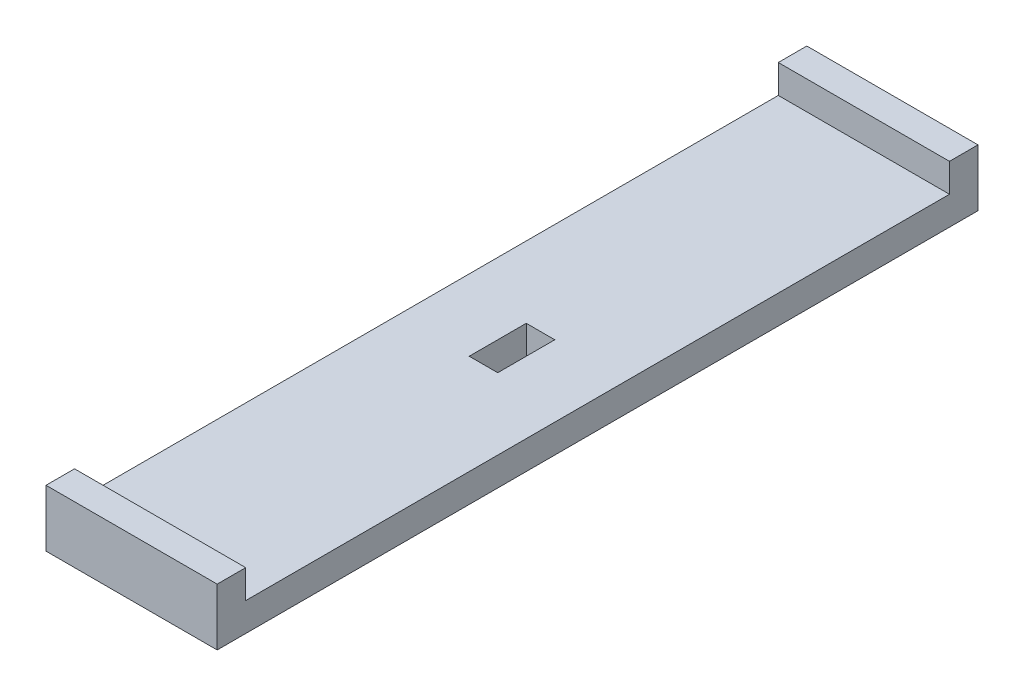
ISO-10303-21;
HEADER;
FILE_DESCRIPTION(('STEP AP214'),'2;1');
FILE_NAME('part.step','',(''),(''),'','','');
FILE_SCHEMA(('AUTOMOTIVE_DESIGN { 1 0 10303 214 1 1 1 1 }'));
ENDSEC;
DATA;
#1=APPLICATION_CONTEXT('core data for automotive mechanical design processes');
#2=APPLICATION_PROTOCOL_DEFINITION('international standard','automotive_design',2000,#1);
#3=PRODUCT_CONTEXT('',#1,'mechanical');
#4=PRODUCT('Part','Part','',(#3));
#5=PRODUCT_RELATED_PRODUCT_CATEGORY('part','',(#4));
#6=PRODUCT_DEFINITION_FORMATION('','',#4);
#7=PRODUCT_DEFINITION_CONTEXT('part definition',#1,'design');
#8=PRODUCT_DEFINITION('design','',#6,#7);
#9=PRODUCT_DEFINITION_SHAPE('','',#8);
#10=(LENGTH_UNIT() NAMED_UNIT(*) SI_UNIT(.MILLI.,.METRE.));
#11=(NAMED_UNIT(*) PLANE_ANGLE_UNIT() SI_UNIT($,.RADIAN.));
#12=(NAMED_UNIT(*) SI_UNIT($,.STERADIAN.) SOLID_ANGLE_UNIT());
#13=UNCERTAINTY_MEASURE_WITH_UNIT(LENGTH_MEASURE(1.E-05),#10,'distance_accuracy_value','');
#14=(GEOMETRIC_REPRESENTATION_CONTEXT(3) GLOBAL_UNCERTAINTY_ASSIGNED_CONTEXT((#13)) GLOBAL_UNIT_ASSIGNED_CONTEXT((#10,
#11,#12)) REPRESENTATION_CONTEXT('',''));
#15=CARTESIAN_POINT('',(0.,0.,0.));
#16=DIRECTION('',(0.,0.,1.));
#17=DIRECTION('',(1.,0.,0.));
#18=AXIS2_PLACEMENT_3D('',#15,#16,#17);
#19=CARTESIAN_POINT('',(0.,3.,0.));
#20=DIRECTION('',(0.,-1.,0.));
#21=DIRECTION('',(0.,0.,-1.));
#22=AXIS2_PLACEMENT_3D('',#19,#20,#21);
#23=PLANE('',#22);
#24=DIRECTION('',(0.,0.,-1.));
#25=VECTOR('',#24,1.);
#26=CARTESIAN_POINT('',(1.5,3.,3.));
#27=LINE('',#26,#25);
#28=CARTESIAN_POINT('',(1.5,3.,3.));
#29=VERTEX_POINT('',#28);
#30=CARTESIAN_POINT('',(1.5,3.,-3.));
#31=VERTEX_POINT('',#30);
#32=EDGE_CURVE('E167',#29,#31,#27,.T.);
#33=ORIENTED_EDGE('',*,*,#32,.F.);
#34=DIRECTION('',(1.,0.,0.));
#35=VECTOR('',#34,1.);
#36=CARTESIAN_POINT('',(-1.5,3.,3.));
#37=LINE('',#36,#35);
#38=CARTESIAN_POINT('',(-1.5,3.,3.));
#39=VERTEX_POINT('',#38);
#40=EDGE_CURVE('E175',#39,#29,#37,.T.);
#41=ORIENTED_EDGE('',*,*,#40,.F.);
#42=DIRECTION('',(0.,0.,1.));
#43=VECTOR('',#42,1.);
#44=CARTESIAN_POINT('',(-1.5,3.,3.));
#45=LINE('',#44,#43);
#46=CARTESIAN_POINT('',(-1.5,3.,-3.));
#47=VERTEX_POINT('',#46);
#48=EDGE_CURVE('E172',#47,#39,#45,.T.);
#49=ORIENTED_EDGE('',*,*,#48,.F.);
#50=DIRECTION('',(-1.,0.,0.));
#51=VECTOR('',#50,1.);
#52=CARTESIAN_POINT('',(-1.5,3.,-3.));
#53=LINE('',#52,#51);
#54=EDGE_CURVE('E169',#31,#47,#53,.T.);
#55=ORIENTED_EDGE('',*,*,#54,.F.);
#56=EDGE_LOOP('',(#33,#41,#49,#55));
#57=FACE_BOUND('',#56,.T.);
#58=DIRECTION('',(1.,0.,0.));
#59=VECTOR('',#58,1.);
#60=CARTESIAN_POINT('',(-9.00000000000001,3.,-37.));
#61=LINE('',#60,#59);
#62=CARTESIAN_POINT('',(-9.00000000000001,3.,-37.));
#63=VERTEX_POINT('',#62);
#64=CARTESIAN_POINT('',(9.,3.,-37.));
#65=VERTEX_POINT('',#64);
#66=EDGE_CURVE('E140',#63,#65,#61,.T.);
#67=ORIENTED_EDGE('',*,*,#66,.F.);
#68=DIRECTION('',(0.,0.,1.));
#69=VECTOR('',#68,1.);
#70=CARTESIAN_POINT('',(-9.,3.,40.));
#71=LINE('',#70,#69);
#72=CARTESIAN_POINT('',(-9.,3.,37.));
#73=VERTEX_POINT('',#72);
#74=EDGE_CURVE('E144',#63,#73,#71,.T.);
#75=ORIENTED_EDGE('',*,*,#74,.T.);
#76=DIRECTION('',(-1.,0.,0.));
#77=VECTOR('',#76,1.);
#78=CARTESIAN_POINT('',(8.99999999999999,3.,37.));
#79=LINE('',#78,#77);
#80=CARTESIAN_POINT('',(9.,3.,37.));
#81=VERTEX_POINT('',#80);
#82=EDGE_CURVE('E52',#81,#73,#79,.T.);
#83=ORIENTED_EDGE('',*,*,#82,.F.);
#84=DIRECTION('',(0.,0.,-1.));
#85=VECTOR('',#84,1.);
#86=CARTESIAN_POINT('',(9.,3.,40.));
#87=LINE('',#86,#85);
#88=EDGE_CURVE('E47',#81,#65,#87,.T.);
#89=ORIENTED_EDGE('',*,*,#88,.T.);
#90=EDGE_LOOP('',(#67,#75,#83,#89));
#91=FACE_BOUND('',#90,.T.);
#92=ADVANCED_FACE('F32',(#57,#91),#23,.F.);
#93=CARTESIAN_POINT('',(0.,0.,0.));
#94=DIRECTION('',(0.,-1.,0.));
#95=DIRECTION('',(0.,0.,-1.));
#96=AXIS2_PLACEMENT_3D('',#93,#94,#95);
#97=PLANE('',#96);
#98=DIRECTION('',(0.,0.,-1.));
#99=VECTOR('',#98,1.);
#100=CARTESIAN_POINT('',(9.,0.,40.));
#101=LINE('',#100,#99);
#102=CARTESIAN_POINT('',(9.,0.,40.));
#103=VERTEX_POINT('',#102);
#104=CARTESIAN_POINT('',(9.,0.,-40.));
#105=VERTEX_POINT('',#104);
#106=EDGE_CURVE('E197',#103,#105,#101,.T.);
#107=ORIENTED_EDGE('',*,*,#106,.F.);
#108=DIRECTION('',(1.,0.,0.));
#109=VECTOR('',#108,1.);
#110=CARTESIAN_POINT('',(-9.,0.,40.));
#111=LINE('',#110,#109);
#112=CARTESIAN_POINT('',(-9.,0.,40.));
#113=VERTEX_POINT('',#112);
#114=EDGE_CURVE('E199',#113,#103,#111,.T.);
#115=ORIENTED_EDGE('',*,*,#114,.F.);
#116=DIRECTION('',(0.,0.,1.));
#117=VECTOR('',#116,1.);
#118=CARTESIAN_POINT('',(-9.,0.,40.));
#119=LINE('',#118,#117);
#120=CARTESIAN_POINT('',(-9.,0.,-40.));
#121=VERTEX_POINT('',#120);
#122=EDGE_CURVE('E206',#121,#113,#119,.T.);
#123=ORIENTED_EDGE('',*,*,#122,.F.);
#124=DIRECTION('',(-1.,0.,0.));
#125=VECTOR('',#124,1.);
#126=CARTESIAN_POINT('',(-9.,0.,-40.));
#127=LINE('',#126,#125);
#128=EDGE_CURVE('E204',#105,#121,#127,.T.);
#129=ORIENTED_EDGE('',*,*,#128,.F.);
#130=EDGE_LOOP('',(#107,#115,#123,#129));
#131=FACE_BOUND('',#130,.T.);
#132=DIRECTION('',(1.,0.,0.));
#133=VECTOR('',#132,1.);
#134=CARTESIAN_POINT('',(-1.5,0.,3.));
#135=LINE('',#134,#133);
#136=CARTESIAN_POINT('',(-1.5,0.,3.));
#137=VERTEX_POINT('',#136);
#138=CARTESIAN_POINT('',(1.5,0.,3.));
#139=VERTEX_POINT('',#138);
#140=EDGE_CURVE('E170',#137,#139,#135,.T.);
#141=ORIENTED_EDGE('',*,*,#140,.T.);
#142=DIRECTION('',(0.,0.,-1.));
#143=VECTOR('',#142,1.);
#144=CARTESIAN_POINT('',(1.5,0.,3.));
#145=LINE('',#144,#143);
#146=CARTESIAN_POINT('',(1.5,0.,-3.));
#147=VERTEX_POINT('',#146);
#148=EDGE_CURVE('E166',#139,#147,#145,.T.);
#149=ORIENTED_EDGE('',*,*,#148,.T.);
#150=DIRECTION('',(-1.,0.,0.));
#151=VECTOR('',#150,1.);
#152=CARTESIAN_POINT('',(-1.5,0.,-3.));
#153=LINE('',#152,#151);
#154=CARTESIAN_POINT('',(-1.5,0.,-3.));
#155=VERTEX_POINT('',#154);
#156=EDGE_CURVE('E180',#147,#155,#153,.T.);
#157=ORIENTED_EDGE('',*,*,#156,.T.);
#158=DIRECTION('',(0.,0.,1.));
#159=VECTOR('',#158,1.);
#160=CARTESIAN_POINT('',(-1.5,0.,3.));
#161=LINE('',#160,#159);
#162=EDGE_CURVE('E183',#155,#137,#161,.T.);
#163=ORIENTED_EDGE('',*,*,#162,.T.);
#164=EDGE_LOOP('',(#141,#149,#157,#163));
#165=FACE_BOUND('',#164,.T.);
#166=ADVANCED_FACE('F218',(#131,#165),#97,.T.);
#167=CARTESIAN_POINT('',(9.,3.,40.));
#168=DIRECTION('',(-1.,0.,0.));
#169=DIRECTION('',(0.,0.,1.));
#170=AXIS2_PLACEMENT_3D('',#167,#168,#169);
#171=PLANE('',#170);
#172=ORIENTED_EDGE('',*,*,#106,.T.);
#173=DIRECTION('',(0.,-1.,0.));
#174=VECTOR('',#173,1.);
#175=CARTESIAN_POINT('',(9.,3.,-40.));
#176=LINE('',#175,#174);
#177=CARTESIAN_POINT('',(8.99999999999999,6.,-40.));
#178=VERTEX_POINT('',#177);
#179=EDGE_CURVE('E11',#178,#105,#176,.T.);
#180=ORIENTED_EDGE('',*,*,#179,.F.);
#181=DIRECTION('',(0.,0.,-1.));
#182=VECTOR('',#181,1.);
#183=CARTESIAN_POINT('',(8.99999999999999,6.,-40.));
#184=LINE('',#183,#182);
#185=CARTESIAN_POINT('',(8.99999999999999,6.,-37.));
#186=VERTEX_POINT('',#185);
#187=EDGE_CURVE('E130',#186,#178,#184,.T.);
#188=ORIENTED_EDGE('',*,*,#187,.F.);
#189=DIRECTION('',(0.,-1.,0.));
#190=VECTOR('',#189,1.);
#191=CARTESIAN_POINT('',(8.99999999999999,6.,-37.));
#192=LINE('',#191,#190);
#193=EDGE_CURVE('E126',#186,#65,#192,.T.);
#194=ORIENTED_EDGE('',*,*,#193,.T.);
#195=ORIENTED_EDGE('',*,*,#88,.F.);
#196=DIRECTION('',(0.,-1.,0.));
#197=VECTOR('',#196,1.);
#198=CARTESIAN_POINT('',(8.99999999999999,6.,37.));
#199=LINE('',#198,#197);
#200=CARTESIAN_POINT('',(8.99999999999999,6.,37.));
#201=VERTEX_POINT('',#200);
#202=EDGE_CURVE('E163',#201,#81,#199,.T.);
#203=ORIENTED_EDGE('',*,*,#202,.F.);
#204=DIRECTION('',(0.,0.,-1.));
#205=VECTOR('',#204,1.);
#206=CARTESIAN_POINT('',(9.,6.,40.));
#207=LINE('',#206,#205);
#208=CARTESIAN_POINT('',(9.,6.,40.));
#209=VERTEX_POINT('',#208);
#210=EDGE_CURVE('E146',#209,#201,#207,.T.);
#211=ORIENTED_EDGE('',*,*,#210,.F.);
#212=DIRECTION('',(0.,-1.,0.));
#213=VECTOR('',#212,1.);
#214=CARTESIAN_POINT('',(9.,3.,40.));
#215=LINE('',#214,#213);
#216=EDGE_CURVE('E201',#209,#103,#215,.T.);
#217=ORIENTED_EDGE('',*,*,#216,.T.);
#218=EDGE_LOOP('',(#172,#180,#188,#194,#195,#203,#211,#217));
#219=FACE_BOUND('',#218,.T.);
#220=ADVANCED_FACE('F34',(#219),#171,.F.);
#221=CARTESIAN_POINT('',(-9.,3.,-40.));
#222=DIRECTION('',(0.,0.,1.));
#223=DIRECTION('',(1.,0.,0.));
#224=AXIS2_PLACEMENT_3D('',#221,#222,#223);
#225=PLANE('',#224);
#226=ORIENTED_EDGE('',*,*,#128,.T.);
#227=DIRECTION('',(0.,-1.,0.));
#228=VECTOR('',#227,1.);
#229=CARTESIAN_POINT('',(-9.,3.,-40.));
#230=LINE('',#229,#228);
#231=CARTESIAN_POINT('',(-9.,6.,-40.));
#232=VERTEX_POINT('',#231);
#233=EDGE_CURVE('E40',#232,#121,#230,.T.);
#234=ORIENTED_EDGE('',*,*,#233,.F.);
#235=DIRECTION('',(-1.,0.,0.));
#236=VECTOR('',#235,1.);
#237=CARTESIAN_POINT('',(-9.,6.,-40.));
#238=LINE('',#237,#236);
#239=EDGE_CURVE('E137',#178,#232,#238,.T.);
#240=ORIENTED_EDGE('',*,*,#239,.F.);
#241=ORIENTED_EDGE('',*,*,#179,.T.);
#242=EDGE_LOOP('',(#226,#234,#240,#241));
#243=FACE_BOUND('',#242,.T.);
#244=ADVANCED_FACE('F258',(#243),#225,.F.);
#245=CARTESIAN_POINT('',(-9.,3.,40.));
#246=DIRECTION('',(1.,0.,0.));
#247=DIRECTION('',(0.,0.,-1.));
#248=AXIS2_PLACEMENT_3D('',#245,#246,#247);
#249=PLANE('',#248);
#250=ORIENTED_EDGE('',*,*,#122,.T.);
#251=DIRECTION('',(0.,-1.,0.));
#252=VECTOR('',#251,1.);
#253=CARTESIAN_POINT('',(-9.,3.,40.));
#254=LINE('',#253,#252);
#255=CARTESIAN_POINT('',(-9.,6.,40.));
#256=VERTEX_POINT('',#255);
#257=EDGE_CURVE('E211',#256,#113,#254,.T.);
#258=ORIENTED_EDGE('',*,*,#257,.F.);
#259=DIRECTION('',(0.,0.,1.));
#260=VECTOR('',#259,1.);
#261=CARTESIAN_POINT('',(-9.,6.,40.));
#262=LINE('',#261,#260);
#263=CARTESIAN_POINT('',(-9.,6.,37.));
#264=VERTEX_POINT('',#263);
#265=EDGE_CURVE('E155',#264,#256,#262,.T.);
#266=ORIENTED_EDGE('',*,*,#265,.F.);
#267=DIRECTION('',(0.,-1.,0.));
#268=VECTOR('',#267,1.);
#269=CARTESIAN_POINT('',(-9.,6.,37.));
#270=LINE('',#269,#268);
#271=EDGE_CURVE('E160',#264,#73,#270,.T.);
#272=ORIENTED_EDGE('',*,*,#271,.T.);
#273=ORIENTED_EDGE('',*,*,#74,.F.);
#274=DIRECTION('',(0.,-1.,0.));
#275=VECTOR('',#274,1.);
#276=CARTESIAN_POINT('',(-9.00000000000001,6.,-37.));
#277=LINE('',#276,#275);
#278=CARTESIAN_POINT('',(-9.00000000000001,6.,-37.));
#279=VERTEX_POINT('',#278);
#280=EDGE_CURVE('E124',#279,#63,#277,.T.);
#281=ORIENTED_EDGE('',*,*,#280,.F.);
#282=DIRECTION('',(0.,0.,1.));
#283=VECTOR('',#282,1.);
#284=CARTESIAN_POINT('',(-9.,6.,-40.));
#285=LINE('',#284,#283);
#286=EDGE_CURVE('E131',#232,#279,#285,.T.);
#287=ORIENTED_EDGE('',*,*,#286,.F.);
#288=ORIENTED_EDGE('',*,*,#233,.T.);
#289=EDGE_LOOP('',(#250,#258,#266,#272,#273,#281,#287,#288));
#290=FACE_BOUND('',#289,.T.);
#291=ADVANCED_FACE('F142',(#290),#249,.F.);
#292=CARTESIAN_POINT('',(-9.,3.,40.));
#293=DIRECTION('',(0.,0.,-1.));
#294=DIRECTION('',(-1.,0.,0.));
#295=AXIS2_PLACEMENT_3D('',#292,#293,#294);
#296=PLANE('',#295);
#297=ORIENTED_EDGE('',*,*,#114,.T.);
#298=ORIENTED_EDGE('',*,*,#216,.F.);
#299=DIRECTION('',(1.,0.,0.));
#300=VECTOR('',#299,1.);
#301=CARTESIAN_POINT('',(9.,6.,40.));
#302=LINE('',#301,#300);
#303=EDGE_CURVE('E158',#256,#209,#302,.T.);
#304=ORIENTED_EDGE('',*,*,#303,.F.);
#305=ORIENTED_EDGE('',*,*,#257,.T.);
#306=EDGE_LOOP('',(#297,#298,#304,#305));
#307=FACE_BOUND('',#306,.T.);
#308=ADVANCED_FACE('F221',(#307),#296,.F.);
#309=CARTESIAN_POINT('',(1.5,3.,3.));
#310=DIRECTION('',(-1.,0.,0.));
#311=DIRECTION('',(0.,0.,1.));
#312=AXIS2_PLACEMENT_3D('',#309,#310,#311);
#313=PLANE('',#312);
#314=ORIENTED_EDGE('',*,*,#148,.F.);
#315=DIRECTION('',(0.,-1.,0.));
#316=VECTOR('',#315,1.);
#317=CARTESIAN_POINT('',(1.5,3.,3.));
#318=LINE('',#317,#316);
#319=EDGE_CURVE('E177',#29,#139,#318,.T.);
#320=ORIENTED_EDGE('',*,*,#319,.F.);
#321=ORIENTED_EDGE('',*,*,#32,.T.);
#322=DIRECTION('',(0.,-1.,0.));
#323=VECTOR('',#322,1.);
#324=CARTESIAN_POINT('',(1.5,3.,-3.));
#325=LINE('',#324,#323);
#326=EDGE_CURVE('E194',#31,#147,#325,.T.);
#327=ORIENTED_EDGE('',*,*,#326,.T.);
#328=EDGE_LOOP('',(#314,#320,#321,#327));
#329=FACE_BOUND('',#328,.T.);
#330=ADVANCED_FACE('F252',(#329),#313,.T.);
#331=CARTESIAN_POINT('',(-1.5,3.,-3.));
#332=DIRECTION('',(0.,0.,1.));
#333=DIRECTION('',(1.,0.,0.));
#334=AXIS2_PLACEMENT_3D('',#331,#332,#333);
#335=PLANE('',#334);
#336=ORIENTED_EDGE('',*,*,#156,.F.);
#337=ORIENTED_EDGE('',*,*,#326,.F.);
#338=ORIENTED_EDGE('',*,*,#54,.T.);
#339=DIRECTION('',(0.,-1.,0.));
#340=VECTOR('',#339,1.);
#341=CARTESIAN_POINT('',(-1.5,3.,-3.));
#342=LINE('',#341,#340);
#343=EDGE_CURVE('E192',#47,#155,#342,.T.);
#344=ORIENTED_EDGE('',*,*,#343,.T.);
#345=EDGE_LOOP('',(#336,#337,#338,#344));
#346=FACE_BOUND('',#345,.T.);
#347=ADVANCED_FACE('F281',(#346),#335,.T.);
#348=CARTESIAN_POINT('',(-1.5,3.,3.));
#349=DIRECTION('',(1.,0.,0.));
#350=DIRECTION('',(0.,0.,-1.));
#351=AXIS2_PLACEMENT_3D('',#348,#349,#350);
#352=PLANE('',#351);
#353=ORIENTED_EDGE('',*,*,#162,.F.);
#354=ORIENTED_EDGE('',*,*,#343,.F.);
#355=ORIENTED_EDGE('',*,*,#48,.T.);
#356=DIRECTION('',(0.,-1.,0.));
#357=VECTOR('',#356,1.);
#358=CARTESIAN_POINT('',(-1.5,3.,3.));
#359=LINE('',#358,#357);
#360=EDGE_CURVE('E190',#39,#137,#359,.T.);
#361=ORIENTED_EDGE('',*,*,#360,.T.);
#362=EDGE_LOOP('',(#353,#354,#355,#361));
#363=FACE_BOUND('',#362,.T.);
#364=ADVANCED_FACE('F240',(#363),#352,.T.);
#365=CARTESIAN_POINT('',(-1.5,3.,3.));
#366=DIRECTION('',(0.,0.,-1.));
#367=DIRECTION('',(-1.,0.,0.));
#368=AXIS2_PLACEMENT_3D('',#365,#366,#367);
#369=PLANE('',#368);
#370=ORIENTED_EDGE('',*,*,#140,.F.);
#371=ORIENTED_EDGE('',*,*,#360,.F.);
#372=ORIENTED_EDGE('',*,*,#40,.T.);
#373=ORIENTED_EDGE('',*,*,#319,.T.);
#374=EDGE_LOOP('',(#370,#371,#372,#373));
#375=FACE_BOUND('',#374,.T.);
#376=ADVANCED_FACE('F233',(#375),#369,.T.);
#377=CARTESIAN_POINT('',(8.99999999999999,6.,37.));
#378=DIRECTION('',(0.,0.,1.));
#379=DIRECTION('',(1.,0.,0.));
#380=AXIS2_PLACEMENT_3D('',#377,#378,#379);
#381=PLANE('',#380);
#382=ORIENTED_EDGE('',*,*,#82,.T.);
#383=ORIENTED_EDGE('',*,*,#271,.F.);
#384=DIRECTION('',(-1.,0.,0.));
#385=VECTOR('',#384,1.);
#386=CARTESIAN_POINT('',(8.99999999999999,6.,37.));
#387=LINE('',#386,#385);
#388=EDGE_CURVE('E153',#201,#264,#387,.T.);
#389=ORIENTED_EDGE('',*,*,#388,.F.);
#390=ORIENTED_EDGE('',*,*,#202,.T.);
#391=EDGE_LOOP('',(#382,#383,#389,#390));
#392=FACE_BOUND('',#391,.T.);
#393=ADVANCED_FACE('F231',(#392),#381,.F.);
#394=CARTESIAN_POINT('',(0.,6.,0.));
#395=DIRECTION('',(0.,1.,0.));
#396=DIRECTION('',(0.,0.,1.));
#397=AXIS2_PLACEMENT_3D('',#394,#395,#396);
#398=PLANE('',#397);
#399=ORIENTED_EDGE('',*,*,#210,.T.);
#400=ORIENTED_EDGE('',*,*,#388,.T.);
#401=ORIENTED_EDGE('',*,*,#265,.T.);
#402=ORIENTED_EDGE('',*,*,#303,.T.);
#403=EDGE_LOOP('',(#399,#400,#401,#402));
#404=FACE_BOUND('',#403,.T.);
#405=ADVANCED_FACE('F227',(#404),#398,.T.);
#406=CARTESIAN_POINT('',(-9.00000000000001,6.,-37.));
#407=DIRECTION('',(0.,0.,-1.));
#408=DIRECTION('',(-1.,0.,0.));
#409=AXIS2_PLACEMENT_3D('',#406,#407,#408);
#410=PLANE('',#409);
#411=ORIENTED_EDGE('',*,*,#66,.T.);
#412=ORIENTED_EDGE('',*,*,#193,.F.);
#413=DIRECTION('',(1.,0.,0.));
#414=VECTOR('',#413,1.);
#415=CARTESIAN_POINT('',(-9.00000000000001,6.,-37.));
#416=LINE('',#415,#414);
#417=EDGE_CURVE('E120',#279,#186,#416,.T.);
#418=ORIENTED_EDGE('',*,*,#417,.F.);
#419=ORIENTED_EDGE('',*,*,#280,.T.);
#420=EDGE_LOOP('',(#411,#412,#418,#419));
#421=FACE_BOUND('',#420,.T.);
#422=ADVANCED_FACE('F122',(#421),#410,.F.);
#423=CARTESIAN_POINT('',(0.,6.,0.));
#424=DIRECTION('',(0.,1.,0.));
#425=DIRECTION('',(0.,0.,1.));
#426=AXIS2_PLACEMENT_3D('',#423,#424,#425);
#427=PLANE('',#426);
#428=ORIENTED_EDGE('',*,*,#286,.T.);
#429=ORIENTED_EDGE('',*,*,#417,.T.);
#430=ORIENTED_EDGE('',*,*,#187,.T.);
#431=ORIENTED_EDGE('',*,*,#239,.T.);
#432=EDGE_LOOP('',(#428,#429,#430,#431));
#433=FACE_BOUND('',#432,.T.);
#434=ADVANCED_FACE('F135',(#433),#427,.T.);
#435=CLOSED_SHELL('',(#92,#166,#220,#244,#291,#308,#330,#347,#364,#376,#393,#405,#422,#434));
#436=MANIFOLD_SOLID_BREP('B2',#435);
#437=ADVANCED_BREP_SHAPE_REPRESENTATION('',(#18,#436),#14);
#438=SHAPE_DEFINITION_REPRESENTATION(#9,#437);
ENDSEC;
END-ISO-10303-21;
